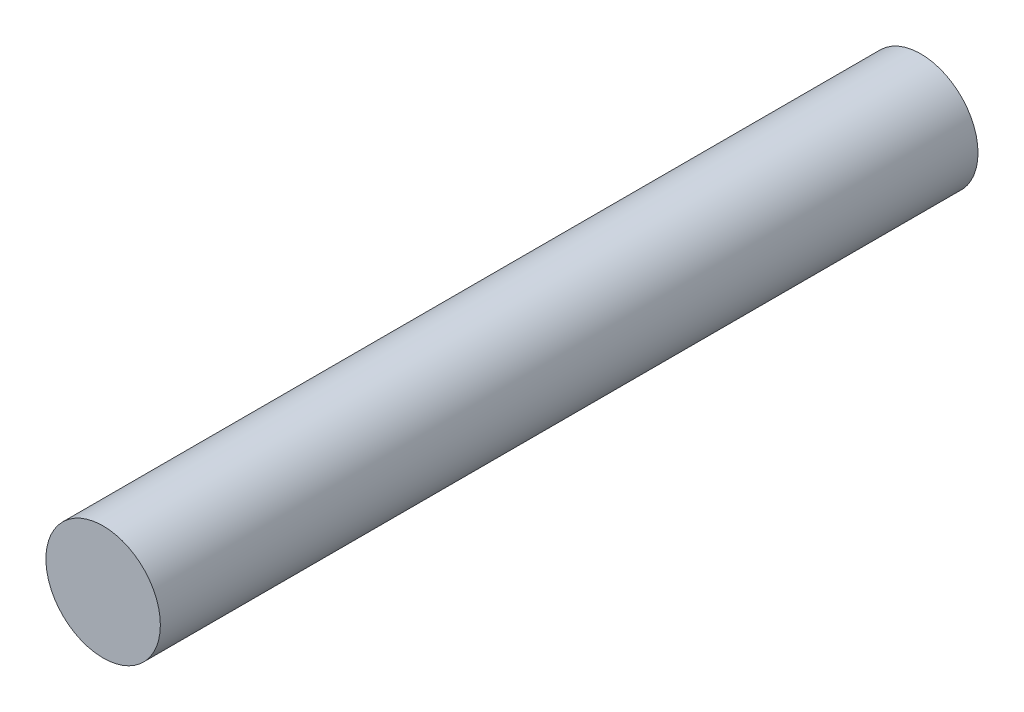
ISO-10303-21;
HEADER;
FILE_DESCRIPTION(('STEP AP214'),'2;1');
FILE_NAME('part.step','',(''),(''),'','','');
FILE_SCHEMA(('AUTOMOTIVE_DESIGN { 1 0 10303 214 1 1 1 1 }'));
ENDSEC;
DATA;
#1=APPLICATION_CONTEXT('core data for automotive mechanical design processes');
#2=APPLICATION_PROTOCOL_DEFINITION('international standard','automotive_design',2000,#1);
#3=PRODUCT_CONTEXT('',#1,'mechanical');
#4=PRODUCT('Part','Part','',(#3));
#5=PRODUCT_RELATED_PRODUCT_CATEGORY('part','',(#4));
#6=PRODUCT_DEFINITION_FORMATION('','',#4);
#7=PRODUCT_DEFINITION_CONTEXT('part definition',#1,'design');
#8=PRODUCT_DEFINITION('design','',#6,#7);
#9=PRODUCT_DEFINITION_SHAPE('','',#8);
#10=(LENGTH_UNIT() NAMED_UNIT(*) SI_UNIT(.MILLI.,.METRE.));
#11=(NAMED_UNIT(*) PLANE_ANGLE_UNIT() SI_UNIT($,.RADIAN.));
#12=(NAMED_UNIT(*) SI_UNIT($,.STERADIAN.) SOLID_ANGLE_UNIT());
#13=UNCERTAINTY_MEASURE_WITH_UNIT(LENGTH_MEASURE(1.E-05),#10,'distance_accuracy_value','');
#14=(GEOMETRIC_REPRESENTATION_CONTEXT(3) GLOBAL_UNCERTAINTY_ASSIGNED_CONTEXT((#13)) GLOBAL_UNIT_ASSIGNED_CONTEXT((#10,
#11,#12)) REPRESENTATION_CONTEXT('',''));
#15=CARTESIAN_POINT('',(0.,0.,0.));
#16=DIRECTION('',(0.,0.,1.));
#17=DIRECTION('',(1.,0.,0.));
#18=AXIS2_PLACEMENT_3D('',#15,#16,#17);
#19=CARTESIAN_POINT('',(0.,0.,55.));
#20=DIRECTION('',(0.,0.,-1.));
#21=DIRECTION('',(-1.,0.,0.));
#22=AXIS2_PLACEMENT_3D('',#19,#20,#21);
#23=CYLINDRICAL_SURFACE('',#22,3.85);
#24=CARTESIAN_POINT('',(0.,0.,55.));
#25=DIRECTION('',(0.,0.,1.));
#26=DIRECTION('',(1.,0.,0.));
#27=AXIS2_PLACEMENT_3D('',#24,#25,#26);
#28=CIRCLE('',#27,3.85);
#29=CARTESIAN_POINT('',(3.85,0.,55.));
#30=VERTEX_POINT('',#29);
#31=EDGE_CURVE('E10',#30,#30,#28,.T.);
#32=ORIENTED_EDGE('',*,*,#31,.F.);
#33=EDGE_LOOP('',(#32));
#34=FACE_BOUND('',#33,.T.);
#35=CARTESIAN_POINT('',(0.,0.,0.));
#36=DIRECTION('',(0.,0.,1.));
#37=DIRECTION('',(1.,0.,0.));
#38=AXIS2_PLACEMENT_3D('',#35,#36,#37);
#39=CIRCLE('',#38,3.85);
#40=CARTESIAN_POINT('',(3.85,0.,0.));
#41=VERTEX_POINT('',#40);
#42=EDGE_CURVE('E36',#41,#41,#39,.T.);
#43=ORIENTED_EDGE('',*,*,#42,.T.);
#44=EDGE_LOOP('',(#43));
#45=FACE_BOUND('',#44,.T.);
#46=ADVANCED_FACE('F33',(#34,#45),#23,.T.);
#47=CARTESIAN_POINT('',(0.,0.,55.));
#48=DIRECTION('',(0.,0.,1.));
#49=DIRECTION('',(1.,0.,0.));
#50=AXIS2_PLACEMENT_3D('',#47,#48,#49);
#51=PLANE('',#50);
#52=ORIENTED_EDGE('',*,*,#31,.T.);
#53=EDGE_LOOP('',(#52));
#54=FACE_BOUND('',#53,.T.);
#55=ADVANCED_FACE('F48',(#54),#51,.T.);
#56=CARTESIAN_POINT('',(0.,0.,0.));
#57=DIRECTION('',(0.,0.,1.));
#58=DIRECTION('',(1.,0.,0.));
#59=AXIS2_PLACEMENT_3D('',#56,#57,#58);
#60=PLANE('',#59);
#61=ORIENTED_EDGE('',*,*,#42,.F.);
#62=EDGE_LOOP('',(#61));
#63=FACE_BOUND('',#62,.T.);
#64=ADVANCED_FACE('F46',(#63),#60,.F.);
#65=CLOSED_SHELL('',(#46,#55,#64));
#66=MANIFOLD_SOLID_BREP('B2',#65);
#67=ADVANCED_BREP_SHAPE_REPRESENTATION('',(#18,#66),#14);
#68=SHAPE_DEFINITION_REPRESENTATION(#9,#67);
ENDSEC;
END-ISO-10303-21;
